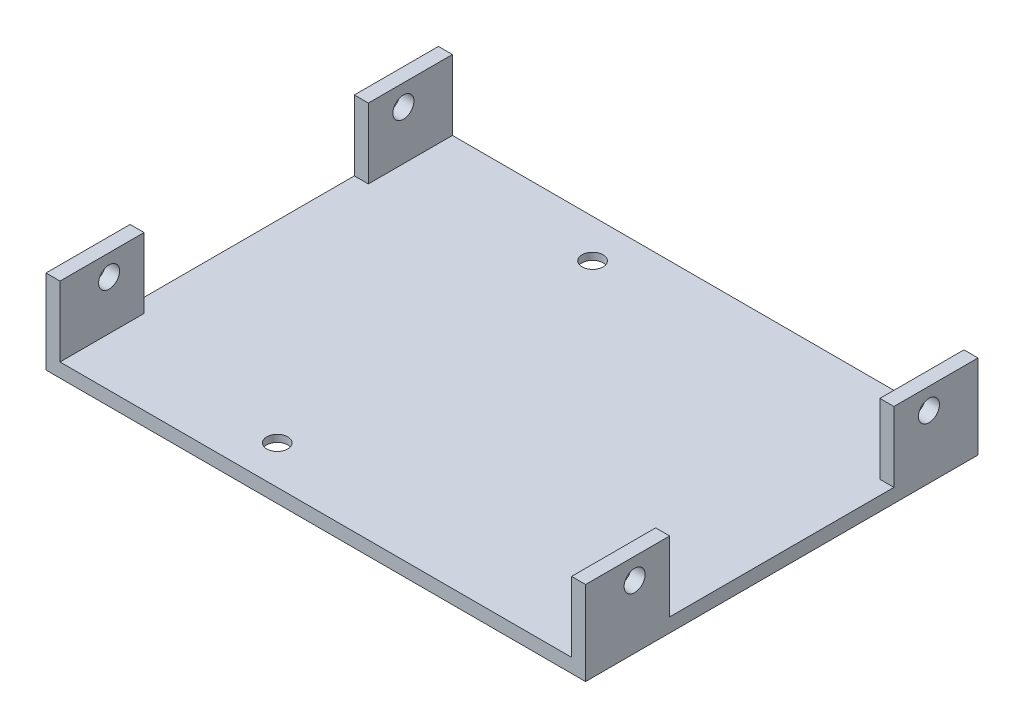
ISO-10303-21;
HEADER;
FILE_DESCRIPTION(('STEP AP214'),'2;1');
FILE_NAME('part.step','',(''),(''),'','','');
FILE_SCHEMA(('AUTOMOTIVE_DESIGN { 1 0 10303 214 1 1 1 1 }'));
ENDSEC;
DATA;
#1=APPLICATION_CONTEXT('core data for automotive mechanical design processes');
#2=APPLICATION_PROTOCOL_DEFINITION('international standard','automotive_design',2000,#1);
#3=PRODUCT_CONTEXT('',#1,'mechanical');
#4=PRODUCT('Part','Part','',(#3));
#5=PRODUCT_RELATED_PRODUCT_CATEGORY('part','',(#4));
#6=PRODUCT_DEFINITION_FORMATION('','',#4);
#7=PRODUCT_DEFINITION_CONTEXT('part definition',#1,'design');
#8=PRODUCT_DEFINITION('design','',#6,#7);
#9=PRODUCT_DEFINITION_SHAPE('','',#8);
#10=(LENGTH_UNIT() NAMED_UNIT(*) SI_UNIT(.MILLI.,.METRE.));
#11=(NAMED_UNIT(*) PLANE_ANGLE_UNIT() SI_UNIT($,.RADIAN.));
#12=(NAMED_UNIT(*) SI_UNIT($,.STERADIAN.) SOLID_ANGLE_UNIT());
#13=UNCERTAINTY_MEASURE_WITH_UNIT(LENGTH_MEASURE(1.E-05),#10,'distance_accuracy_value','');
#14=(GEOMETRIC_REPRESENTATION_CONTEXT(3) GLOBAL_UNCERTAINTY_ASSIGNED_CONTEXT((#13)) GLOBAL_UNIT_ASSIGNED_CONTEXT((#10,
#11,#12)) REPRESENTATION_CONTEXT('',''));
#15=CARTESIAN_POINT('',(0.,0.,0.));
#16=DIRECTION('',(0.,0.,1.));
#17=DIRECTION('',(1.,0.,0.));
#18=AXIS2_PLACEMENT_3D('',#15,#16,#17);
#19=CARTESIAN_POINT('',(30.8794749403342,0.,-16.409307875895));
#20=DIRECTION('',(0.,1.,0.));
#21=DIRECTION('',(0.,0.,1.));
#22=AXIS2_PLACEMENT_3D('',#19,#20,#21);
#23=CYLINDRICAL_SURFACE('',#22,1.50000000000001);
#24=CARTESIAN_POINT('',(30.8794749403342,2.,-16.409307875895));
#25=DIRECTION('',(0.,1.,0.));
#26=DIRECTION('',(0.,0.,1.));
#27=AXIS2_PLACEMENT_3D('',#24,#25,#26);
#28=CIRCLE('',#27,1.50000000000001);
#29=CARTESIAN_POINT('',(30.8794749403342,2.,-14.909307875895));
#30=VERTEX_POINT('',#29);
#31=EDGE_CURVE('E264',#30,#30,#28,.T.);
#32=ORIENTED_EDGE('',*,*,#31,.T.);
#33=EDGE_LOOP('',(#32));
#34=FACE_BOUND('',#33,.T.);
#35=CARTESIAN_POINT('',(30.8794749403342,1.,-16.409307875895));
#36=DIRECTION('',(0.,-1.,0.));
#37=DIRECTION('',(0.,0.,-1.));
#38=AXIS2_PLACEMENT_3D('',#35,#36,#37);
#39=CIRCLE('',#38,1.50000000000001);
#40=CARTESIAN_POINT('',(30.8794749403342,1.,-17.909307875895));
#41=VERTEX_POINT('',#40);
#42=EDGE_CURVE('E37',#41,#41,#39,.F.);
#43=ORIENTED_EDGE('',*,*,#42,.F.);
#44=EDGE_LOOP('',(#43));
#45=FACE_BOUND('',#44,.T.);
#46=ADVANCED_FACE('F33',(#34,#45),#23,.F.);
#47=CARTESIAN_POINT('',(-14.1205250596658,0.,28.590692124105));
#48=DIRECTION('',(0.,1.,0.));
#49=DIRECTION('',(0.,0.,1.));
#50=AXIS2_PLACEMENT_3D('',#47,#48,#49);
#51=CYLINDRICAL_SURFACE('',#50,1.5);
#52=CARTESIAN_POINT('',(-14.1205250596658,2.,28.590692124105));
#53=DIRECTION('',(0.,1.,0.));
#54=DIRECTION('',(0.,0.,1.));
#55=AXIS2_PLACEMENT_3D('',#52,#53,#54);
#56=CIRCLE('',#55,1.5);
#57=CARTESIAN_POINT('',(-14.1205250596658,2.,30.090692124105));
#58=VERTEX_POINT('',#57);
#59=EDGE_CURVE('E257',#58,#58,#56,.T.);
#60=ORIENTED_EDGE('',*,*,#59,.T.);
#61=EDGE_LOOP('',(#60));
#62=FACE_BOUND('',#61,.T.);
#63=CARTESIAN_POINT('',(-14.1205250596658,1.,28.590692124105));
#64=DIRECTION('',(0.,-1.,0.));
#65=DIRECTION('',(0.,0.,-1.));
#66=AXIS2_PLACEMENT_3D('',#63,#64,#65);
#67=CIRCLE('',#66,1.5);
#68=CARTESIAN_POINT('',(-14.1205250596658,1.,27.090692124105));
#69=VERTEX_POINT('',#68);
#70=EDGE_CURVE('E304',#69,#69,#67,.F.);
#71=ORIENTED_EDGE('',*,*,#70,.F.);
#72=EDGE_LOOP('',(#71));
#73=FACE_BOUND('',#72,.T.);
#74=ADVANCED_FACE('F346',(#62,#73),#51,.F.);
#75=CARTESIAN_POINT('',(-14.1205250596658,0.,-16.409307875895));
#76=DIRECTION('',(0.,1.,0.));
#77=DIRECTION('',(0.,0.,1.));
#78=AXIS2_PLACEMENT_3D('',#75,#76,#77);
#79=CYLINDRICAL_SURFACE('',#78,1.5);
#80=CARTESIAN_POINT('',(-14.1205250596658,2.,-16.409307875895));
#81=DIRECTION('',(0.,1.,0.));
#82=DIRECTION('',(0.,0.,1.));
#83=AXIS2_PLACEMENT_3D('',#80,#81,#82);
#84=CIRCLE('',#83,1.5);
#85=CARTESIAN_POINT('',(-14.1205250596658,2.,-14.909307875895));
#86=VERTEX_POINT('',#85);
#87=EDGE_CURVE('E260',#86,#86,#84,.T.);
#88=ORIENTED_EDGE('',*,*,#87,.T.);
#89=EDGE_LOOP('',(#88));
#90=FACE_BOUND('',#89,.T.);
#91=CARTESIAN_POINT('',(-14.1205250596658,1.,-16.409307875895));
#92=DIRECTION('',(0.,-1.,0.));
#93=DIRECTION('',(0.,0.,-1.));
#94=AXIS2_PLACEMENT_3D('',#91,#92,#93);
#95=CIRCLE('',#94,1.5);
#96=CARTESIAN_POINT('',(-14.1205250596658,1.,-17.909307875895));
#97=VERTEX_POINT('',#96);
#98=EDGE_CURVE('E301',#97,#97,#95,.F.);
#99=ORIENTED_EDGE('',*,*,#98,.F.);
#100=EDGE_LOOP('',(#99));
#101=FACE_BOUND('',#100,.T.);
#102=ADVANCED_FACE('F352',(#90,#101),#79,.F.);
#103=CARTESIAN_POINT('',(30.8794749403342,0.,28.590692124105));
#104=DIRECTION('',(0.,1.,0.));
#105=DIRECTION('',(0.,0.,1.));
#106=AXIS2_PLACEMENT_3D('',#103,#104,#105);
#107=CYLINDRICAL_SURFACE('',#106,1.50000000000001);
#108=CARTESIAN_POINT('',(30.8794749403342,2.,28.590692124105));
#109=DIRECTION('',(0.,1.,0.));
#110=DIRECTION('',(0.,0.,1.));
#111=AXIS2_PLACEMENT_3D('',#108,#109,#110);
#112=CIRCLE('',#111,1.50000000000001);
#113=CARTESIAN_POINT('',(30.8794749403342,2.,30.090692124105));
#114=VERTEX_POINT('',#113);
#115=EDGE_CURVE('E261',#114,#114,#112,.T.);
#116=ORIENTED_EDGE('',*,*,#115,.T.);
#117=EDGE_LOOP('',(#116));
#118=FACE_BOUND('',#117,.T.);
#119=CARTESIAN_POINT('',(30.8794749403342,1.,28.590692124105));
#120=DIRECTION('',(0.,-1.,0.));
#121=DIRECTION('',(0.,0.,-1.));
#122=AXIS2_PLACEMENT_3D('',#119,#120,#121);
#123=CIRCLE('',#122,1.50000000000001);
#124=CARTESIAN_POINT('',(30.8794749403342,1.,27.090692124105));
#125=VERTEX_POINT('',#124);
#126=EDGE_CURVE('E298',#125,#125,#123,.F.);
#127=ORIENTED_EDGE('',*,*,#126,.F.);
#128=EDGE_LOOP('',(#127));
#129=FACE_BOUND('',#128,.T.);
#130=ADVANCED_FACE('F362',(#118,#129),#107,.F.);
#131=CARTESIAN_POINT('',(0.,2.,0.));
#132=DIRECTION('',(0.,1.,0.));
#133=DIRECTION('',(0.,0.,1.));
#134=AXIS2_PLACEMENT_3D('',#131,#132,#133);
#135=PLANE('',#134);
#136=ORIENTED_EDGE('',*,*,#115,.F.);
#137=EDGE_LOOP('',(#136));
#138=FACE_BOUND('',#137,.T.);
#139=ORIENTED_EDGE('',*,*,#87,.F.);
#140=EDGE_LOOP('',(#139));
#141=FACE_BOUND('',#140,.T.);
#142=ORIENTED_EDGE('',*,*,#59,.F.);
#143=EDGE_LOOP('',(#142));
#144=FACE_BOUND('',#143,.T.);
#145=ORIENTED_EDGE('',*,*,#31,.F.);
#146=EDGE_LOOP('',(#145));
#147=FACE_BOUND('',#146,.T.);
#148=DIRECTION('',(-1.,0.,0.));
#149=VECTOR('',#148,1.);
#150=CARTESIAN_POINT('',(-41.6205250596658,2.,22.090692124105));
#151=LINE('',#150,#149);
#152=CARTESIAN_POINT('',(-39.6205250596658,2.,22.090692124105));
#153=VERTEX_POINT('',#152);
#154=CARTESIAN_POINT('',(-41.6205250596658,2.,22.090692124105));
#155=VERTEX_POINT('',#154);
#156=EDGE_CURVE('E50',#153,#155,#151,.T.);
#157=ORIENTED_EDGE('',*,*,#156,.F.);
#158=DIRECTION('',(0.,0.,-1.));
#159=VECTOR('',#158,1.);
#160=CARTESIAN_POINT('',(-39.6205250596658,2.,22.090692124105));
#161=LINE('',#160,#159);
#162=CARTESIAN_POINT('',(-39.6205250596658,2.,34.090692124105));
#163=VERTEX_POINT('',#162);
#164=EDGE_CURVE('E169',#163,#153,#161,.T.);
#165=ORIENTED_EDGE('',*,*,#164,.F.);
#166=DIRECTION('',(1.,0.,0.));
#167=VECTOR('',#166,1.);
#168=CARTESIAN_POINT('',(-41.6205250596658,2.,34.090692124105));
#169=LINE('',#168,#167);
#170=CARTESIAN_POINT('',(33.3794749403342,2.,34.090692124105));
#171=VERTEX_POINT('',#170);
#172=EDGE_CURVE('E270',#163,#171,#169,.T.);
#173=ORIENTED_EDGE('',*,*,#172,.T.);
#174=DIRECTION('',(0.,0.,1.));
#175=VECTOR('',#174,1.);
#176=CARTESIAN_POINT('',(33.3794749403342,2.,22.090692124105));
#177=LINE('',#176,#175);
#178=CARTESIAN_POINT('',(33.3794749403342,2.,22.090692124105));
#179=VERTEX_POINT('',#178);
#180=EDGE_CURVE('E209',#179,#171,#177,.T.);
#181=ORIENTED_EDGE('',*,*,#180,.F.);
#182=DIRECTION('',(-1.,0.,0.));
#183=VECTOR('',#182,1.);
#184=CARTESIAN_POINT('',(33.3794749403342,2.,22.090692124105));
#185=LINE('',#184,#183);
#186=CARTESIAN_POINT('',(35.3794749403342,2.,22.090692124105));
#187=VERTEX_POINT('',#186);
#188=EDGE_CURVE('E214',#187,#179,#185,.T.);
#189=ORIENTED_EDGE('',*,*,#188,.F.);
#190=DIRECTION('',(0.,0.,-1.));
#191=VECTOR('',#190,1.);
#192=CARTESIAN_POINT('',(35.3794749403341,2.,-21.909307875895));
#193=LINE('',#192,#191);
#194=CARTESIAN_POINT('',(35.3794749403342,2.,-9.90930787589499));
#195=VERTEX_POINT('',#194);
#196=EDGE_CURVE('E273',#187,#195,#193,.T.);
#197=ORIENTED_EDGE('',*,*,#196,.T.);
#198=DIRECTION('',(1.,0.,0.));
#199=VECTOR('',#198,1.);
#200=CARTESIAN_POINT('',(33.3794749403342,2.,-9.90930787589499));
#201=LINE('',#200,#199);
#202=CARTESIAN_POINT('',(33.3794749403342,2.,-9.90930787589499));
#203=VERTEX_POINT('',#202);
#204=EDGE_CURVE('E237',#203,#195,#201,.T.);
#205=ORIENTED_EDGE('',*,*,#204,.F.);
#206=DIRECTION('',(0.,0.,1.));
#207=VECTOR('',#206,1.);
#208=CARTESIAN_POINT('',(33.3794749403342,2.,-21.909307875895));
#209=LINE('',#208,#207);
#210=CARTESIAN_POINT('',(33.3794749403342,2.,-21.909307875895));
#211=VERTEX_POINT('',#210);
#212=EDGE_CURVE('E232',#211,#203,#209,.T.);
#213=ORIENTED_EDGE('',*,*,#212,.F.);
#214=DIRECTION('',(-1.,0.,0.));
#215=VECTOR('',#214,1.);
#216=CARTESIAN_POINT('',(-41.6205250596658,2.,-21.909307875895));
#217=LINE('',#216,#215);
#218=CARTESIAN_POINT('',(-39.6205250596658,2.,-21.909307875895));
#219=VERTEX_POINT('',#218);
#220=EDGE_CURVE('E275',#211,#219,#217,.T.);
#221=ORIENTED_EDGE('',*,*,#220,.T.);
#222=DIRECTION('',(0.,0.,-1.));
#223=VECTOR('',#222,1.);
#224=CARTESIAN_POINT('',(-39.6205250596658,2.,-21.909307875895));
#225=LINE('',#224,#223);
#226=CARTESIAN_POINT('',(-39.6205250596658,2.,-9.90930787589499));
#227=VERTEX_POINT('',#226);
#228=EDGE_CURVE('E189',#227,#219,#225,.T.);
#229=ORIENTED_EDGE('',*,*,#228,.F.);
#230=DIRECTION('',(1.,0.,0.));
#231=VECTOR('',#230,1.);
#232=CARTESIAN_POINT('',(-41.6205250596658,2.,-9.90930787589499));
#233=LINE('',#232,#231);
#234=CARTESIAN_POINT('',(-41.6205250596658,2.,-9.90930787589499));
#235=VERTEX_POINT('',#234);
#236=EDGE_CURVE('E184',#235,#227,#233,.T.);
#237=ORIENTED_EDGE('',*,*,#236,.F.);
#238=DIRECTION('',(0.,0.,1.));
#239=VECTOR('',#238,1.);
#240=CARTESIAN_POINT('',(-41.6205250596658,2.,-21.909307875895));
#241=LINE('',#240,#239);
#242=EDGE_CURVE('E55',#235,#155,#241,.T.);
#243=ORIENTED_EDGE('',*,*,#242,.T.);
#244=EDGE_LOOP('',(#157,#165,#173,#181,#189,#197,#205,#213,#221,#229,#237,#243));
#245=FACE_BOUND('',#244,.T.);
#246=ADVANCED_FACE('F359',(#138,#141,#144,#147,#245),#135,.T.);
#247=CARTESIAN_POINT('',(-41.6205250596658,2.,-21.909307875895));
#248=DIRECTION('',(1.,0.,0.));
#249=DIRECTION('',(0.,0.,-1.));
#250=AXIS2_PLACEMENT_3D('',#247,#248,#249);
#251=PLANE('',#250);
#252=CARTESIAN_POINT('',(-41.6205250596658,9.,27.090692124105));
#253=DIRECTION('',(1.,0.,0.));
#254=DIRECTION('',(0.,0.,-1.));
#255=AXIS2_PLACEMENT_3D('',#252,#253,#254);
#256=CIRCLE('',#255,1.5);
#257=CARTESIAN_POINT('',(-41.6205250596658,9.,25.590692124105));
#258=VERTEX_POINT('',#257);
#259=EDGE_CURVE('E294',#258,#258,#256,.T.);
#260=ORIENTED_EDGE('',*,*,#259,.T.);
#261=EDGE_LOOP('',(#260));
#262=FACE_BOUND('',#261,.T.);
#263=CARTESIAN_POINT('',(-41.6205250596658,9.,-14.909307875895));
#264=DIRECTION('',(1.,0.,0.));
#265=DIRECTION('',(0.,0.,-1.));
#266=AXIS2_PLACEMENT_3D('',#263,#264,#265);
#267=CIRCLE('',#266,1.5);
#268=CARTESIAN_POINT('',(-41.6205250596658,9.,-16.409307875895));
#269=VERTEX_POINT('',#268);
#270=EDGE_CURVE('E313',#269,#269,#267,.T.);
#271=ORIENTED_EDGE('',*,*,#270,.T.);
#272=EDGE_LOOP('',(#271));
#273=FACE_BOUND('',#272,.T.);
#274=DIRECTION('',(0.,0.,1.));
#275=VECTOR('',#274,1.);
#276=CARTESIAN_POINT('',(-41.6205250596658,0.,-21.909307875895));
#277=LINE('',#276,#275);
#278=CARTESIAN_POINT('',(-41.6205250596658,0.,-21.909307875895));
#279=VERTEX_POINT('',#278);
#280=CARTESIAN_POINT('',(-41.6205250596658,0.,34.090692124105));
#281=VERTEX_POINT('',#280);
#282=EDGE_CURVE('E153',#279,#281,#277,.T.);
#283=ORIENTED_EDGE('',*,*,#282,.T.);
#284=DIRECTION('',(0.,-1.,0.));
#285=VECTOR('',#284,1.);
#286=CARTESIAN_POINT('',(-41.6205250596658,2.,34.090692124105));
#287=LINE('',#286,#285);
#288=CARTESIAN_POINT('',(-41.6205250596658,12.,34.090692124105));
#289=VERTEX_POINT('',#288);
#290=EDGE_CURVE('E11',#289,#281,#287,.T.);
#291=ORIENTED_EDGE('',*,*,#290,.F.);
#292=DIRECTION('',(0.,0.,1.));
#293=VECTOR('',#292,1.);
#294=CARTESIAN_POINT('',(-41.6205250596658,12.,22.090692124105));
#295=LINE('',#294,#293);
#296=CARTESIAN_POINT('',(-41.6205250596658,12.,22.090692124105));
#297=VERTEX_POINT('',#296);
#298=EDGE_CURVE('E150',#297,#289,#295,.T.);
#299=ORIENTED_EDGE('',*,*,#298,.F.);
#300=DIRECTION('',(0.,-1.,0.));
#301=VECTOR('',#300,1.);
#302=CARTESIAN_POINT('',(-41.6205250596658,12.,22.090692124105));
#303=LINE('',#302,#301);
#304=EDGE_CURVE('E177',#297,#155,#303,.T.);
#305=ORIENTED_EDGE('',*,*,#304,.T.);
#306=ORIENTED_EDGE('',*,*,#242,.F.);
#307=DIRECTION('',(0.,-1.,0.));
#308=VECTOR('',#307,1.);
#309=CARTESIAN_POINT('',(-41.6205250596658,12.,-9.90930787589499));
#310=LINE('',#309,#308);
#311=CARTESIAN_POINT('',(-41.6205250596658,12.,-9.90930787589499));
#312=VERTEX_POINT('',#311);
#313=EDGE_CURVE('E206',#312,#235,#310,.T.);
#314=ORIENTED_EDGE('',*,*,#313,.F.);
#315=DIRECTION('',(0.,0.,1.));
#316=VECTOR('',#315,1.);
#317=CARTESIAN_POINT('',(-41.6205250596658,12.,-21.909307875895));
#318=LINE('',#317,#316);
#319=CARTESIAN_POINT('',(-41.6205250596658,12.,-21.909307875895));
#320=VERTEX_POINT('',#319);
#321=EDGE_CURVE('E185',#320,#312,#318,.T.);
#322=ORIENTED_EDGE('',*,*,#321,.F.);
#323=DIRECTION('',(0.,-1.,0.));
#324=VECTOR('',#323,1.);
#325=CARTESIAN_POINT('',(-41.6205250596658,2.,-21.909307875895));
#326=LINE('',#325,#324);
#327=EDGE_CURVE('E277',#320,#279,#326,.T.);
#328=ORIENTED_EDGE('',*,*,#327,.T.);
#329=EDGE_LOOP('',(#283,#291,#299,#305,#306,#314,#322,#328));
#330=FACE_BOUND('',#329,.T.);
#331=ADVANCED_FACE('F35',(#262,#273,#330),#251,.F.);
#332=CARTESIAN_POINT('',(-41.6205250596658,2.,34.090692124105));
#333=DIRECTION('',(0.,0.,-1.));
#334=DIRECTION('',(-1.,0.,0.));
#335=AXIS2_PLACEMENT_3D('',#332,#333,#334);
#336=PLANE('',#335);
#337=DIRECTION('',(1.,0.,0.));
#338=VECTOR('',#337,1.);
#339=CARTESIAN_POINT('',(-41.6205250596658,0.,34.090692124105));
#340=LINE('',#339,#338);
#341=CARTESIAN_POINT('',(35.3794749403342,0.,34.090692124105));
#342=VERTEX_POINT('',#341);
#343=EDGE_CURVE('E279',#281,#342,#340,.T.);
#344=ORIENTED_EDGE('',*,*,#343,.T.);
#345=DIRECTION('',(0.,-1.,0.));
#346=VECTOR('',#345,1.);
#347=CARTESIAN_POINT('',(35.3794749403342,2.,34.090692124105));
#348=LINE('',#347,#346);
#349=CARTESIAN_POINT('',(35.3794749403342,12.,34.090692124105));
#350=VERTEX_POINT('',#349);
#351=EDGE_CURVE('E42',#350,#342,#348,.T.);
#352=ORIENTED_EDGE('',*,*,#351,.F.);
#353=DIRECTION('',(1.,0.,0.));
#354=VECTOR('',#353,1.);
#355=CARTESIAN_POINT('',(33.3794749403342,12.,34.090692124105));
#356=LINE('',#355,#354);
#357=CARTESIAN_POINT('',(33.3794749403342,12.,34.090692124105));
#358=VERTEX_POINT('',#357);
#359=EDGE_CURVE('E213',#358,#350,#356,.T.);
#360=ORIENTED_EDGE('',*,*,#359,.F.);
#361=DIRECTION('',(0.,-1.,0.));
#362=VECTOR('',#361,1.);
#363=CARTESIAN_POINT('',(33.3794749403342,12.,34.090692124105));
#364=LINE('',#363,#362);
#365=EDGE_CURVE('E229',#358,#171,#364,.T.);
#366=ORIENTED_EDGE('',*,*,#365,.T.);
#367=ORIENTED_EDGE('',*,*,#172,.F.);
#368=DIRECTION('',(0.,-1.,0.));
#369=VECTOR('',#368,1.);
#370=CARTESIAN_POINT('',(-39.6205250596658,12.,34.090692124105));
#371=LINE('',#370,#369);
#372=CARTESIAN_POINT('',(-39.6205250596658,12.,34.090692124105));
#373=VERTEX_POINT('',#372);
#374=EDGE_CURVE('E159',#373,#163,#371,.T.);
#375=ORIENTED_EDGE('',*,*,#374,.F.);
#376=DIRECTION('',(1.,0.,0.));
#377=VECTOR('',#376,1.);
#378=CARTESIAN_POINT('',(-41.6205250596658,12.,34.090692124105));
#379=LINE('',#378,#377);
#380=EDGE_CURVE('E156',#289,#373,#379,.T.);
#381=ORIENTED_EDGE('',*,*,#380,.F.);
#382=ORIENTED_EDGE('',*,*,#290,.T.);
#383=EDGE_LOOP('',(#344,#352,#360,#366,#367,#375,#381,#382));
#384=FACE_BOUND('',#383,.T.);
#385=ADVANCED_FACE('F157',(#384),#336,.F.);
#386=CARTESIAN_POINT('',(35.3794749403341,2.,-21.909307875895));
#387=DIRECTION('',(-1.,0.,0.));
#388=DIRECTION('',(0.,0.,1.));
#389=AXIS2_PLACEMENT_3D('',#386,#387,#388);
#390=PLANE('',#389);
#391=CARTESIAN_POINT('',(35.3794749403341,9.,27.090692124105));
#392=DIRECTION('',(1.,0.,0.));
#393=DIRECTION('',(0.,0.,-1.));
#394=AXIS2_PLACEMENT_3D('',#391,#392,#393);
#395=CIRCLE('',#394,1.5);
#396=CARTESIAN_POINT('',(35.3794749403341,9.,25.590692124105));
#397=VERTEX_POINT('',#396);
#398=EDGE_CURVE('E318',#397,#397,#395,.T.);
#399=ORIENTED_EDGE('',*,*,#398,.F.);
#400=EDGE_LOOP('',(#399));
#401=FACE_BOUND('',#400,.T.);
#402=CARTESIAN_POINT('',(35.3794749403341,9.,-14.909307875895));
#403=DIRECTION('',(1.,0.,0.));
#404=DIRECTION('',(0.,0.,-1.));
#405=AXIS2_PLACEMENT_3D('',#402,#403,#404);
#406=CIRCLE('',#405,1.5);
#407=CARTESIAN_POINT('',(35.3794749403341,9.,-16.409307875895));
#408=VERTEX_POINT('',#407);
#409=EDGE_CURVE('E309',#408,#408,#406,.T.);
#410=ORIENTED_EDGE('',*,*,#409,.F.);
#411=EDGE_LOOP('',(#410));
#412=FACE_BOUND('',#411,.T.);
#413=DIRECTION('',(0.,0.,-1.));
#414=VECTOR('',#413,1.);
#415=CARTESIAN_POINT('',(35.3794749403341,0.,-21.909307875895));
#416=LINE('',#415,#414);
#417=CARTESIAN_POINT('',(35.3794749403341,0.,-21.909307875895));
#418=VERTEX_POINT('',#417);
#419=EDGE_CURVE('E281',#342,#418,#416,.T.);
#420=ORIENTED_EDGE('',*,*,#419,.T.);
#421=DIRECTION('',(0.,-1.,0.));
#422=VECTOR('',#421,1.);
#423=CARTESIAN_POINT('',(35.3794749403341,2.,-21.909307875895));
#424=LINE('',#423,#422);
#425=CARTESIAN_POINT('',(35.3794749403342,12.,-21.909307875895));
#426=VERTEX_POINT('',#425);
#427=EDGE_CURVE('E285',#426,#418,#424,.T.);
#428=ORIENTED_EDGE('',*,*,#427,.F.);
#429=DIRECTION('',(0.,0.,-1.));
#430=VECTOR('',#429,1.);
#431=CARTESIAN_POINT('',(35.3794749403342,12.,-21.909307875895));
#432=LINE('',#431,#430);
#433=CARTESIAN_POINT('',(35.3794749403342,12.,-9.90930787589499));
#434=VERTEX_POINT('',#433);
#435=EDGE_CURVE('E239',#434,#426,#432,.T.);
#436=ORIENTED_EDGE('',*,*,#435,.F.);
#437=DIRECTION('',(0.,-1.,0.));
#438=VECTOR('',#437,1.);
#439=CARTESIAN_POINT('',(35.3794749403342,12.,-9.90930787589499));
#440=LINE('',#439,#438);
#441=EDGE_CURVE('E251',#434,#195,#440,.T.);
#442=ORIENTED_EDGE('',*,*,#441,.T.);
#443=ORIENTED_EDGE('',*,*,#196,.F.);
#444=DIRECTION('',(0.,-1.,0.));
#445=VECTOR('',#444,1.);
#446=CARTESIAN_POINT('',(35.3794749403342,12.,22.090692124105));
#447=LINE('',#446,#445);
#448=CARTESIAN_POINT('',(35.3794749403342,12.,22.090692124105));
#449=VERTEX_POINT('',#448);
#450=EDGE_CURVE('E227',#449,#187,#447,.T.);
#451=ORIENTED_EDGE('',*,*,#450,.F.);
#452=DIRECTION('',(0.,0.,-1.));
#453=VECTOR('',#452,1.);
#454=CARTESIAN_POINT('',(35.3794749403342,12.,22.090692124105));
#455=LINE('',#454,#453);
#456=EDGE_CURVE('E217',#350,#449,#455,.T.);
#457=ORIENTED_EDGE('',*,*,#456,.F.);
#458=ORIENTED_EDGE('',*,*,#351,.T.);
#459=EDGE_LOOP('',(#420,#428,#436,#442,#443,#451,#457,#458));
#460=FACE_BOUND('',#459,.T.);
#461=ADVANCED_FACE('F372',(#401,#412,#460),#390,.F.);
#462=CARTESIAN_POINT('',(-41.6205250596658,2.,-21.909307875895));
#463=DIRECTION('',(0.,0.,1.));
#464=DIRECTION('',(1.,0.,0.));
#465=AXIS2_PLACEMENT_3D('',#462,#463,#464);
#466=PLANE('',#465);
#467=DIRECTION('',(-1.,0.,0.));
#468=VECTOR('',#467,1.);
#469=CARTESIAN_POINT('',(-41.6205250596658,0.,-21.909307875895));
#470=LINE('',#469,#468);
#471=EDGE_CURVE('E271',#418,#279,#470,.T.);
#472=ORIENTED_EDGE('',*,*,#471,.T.);
#473=ORIENTED_EDGE('',*,*,#327,.F.);
#474=DIRECTION('',(-1.,0.,0.));
#475=VECTOR('',#474,1.);
#476=CARTESIAN_POINT('',(-41.6205250596658,12.,-21.909307875895));
#477=LINE('',#476,#475);
#478=CARTESIAN_POINT('',(-39.6205250596658,12.,-21.909307875895));
#479=VERTEX_POINT('',#478);
#480=EDGE_CURVE('E193',#479,#320,#477,.T.);
#481=ORIENTED_EDGE('',*,*,#480,.F.);
#482=DIRECTION('',(0.,-1.,0.));
#483=VECTOR('',#482,1.);
#484=CARTESIAN_POINT('',(-39.6205250596658,12.,-21.909307875895));
#485=LINE('',#484,#483);
#486=EDGE_CURVE('E196',#479,#219,#485,.T.);
#487=ORIENTED_EDGE('',*,*,#486,.T.);
#488=ORIENTED_EDGE('',*,*,#220,.F.);
#489=DIRECTION('',(0.,-1.,0.));
#490=VECTOR('',#489,1.);
#491=CARTESIAN_POINT('',(33.3794749403342,12.,-21.909307875895));
#492=LINE('',#491,#490);
#493=CARTESIAN_POINT('',(33.3794749403342,12.,-21.909307875895));
#494=VERTEX_POINT('',#493);
#495=EDGE_CURVE('E244',#494,#211,#492,.T.);
#496=ORIENTED_EDGE('',*,*,#495,.F.);
#497=DIRECTION('',(-1.,0.,0.));
#498=VECTOR('',#497,1.);
#499=CARTESIAN_POINT('',(33.3794749403342,12.,-21.909307875895));
#500=LINE('',#499,#498);
#501=EDGE_CURVE('E242',#426,#494,#500,.T.);
#502=ORIENTED_EDGE('',*,*,#501,.F.);
#503=ORIENTED_EDGE('',*,*,#427,.T.);
#504=EDGE_LOOP('',(#472,#473,#481,#487,#488,#496,#502,#503));
#505=FACE_BOUND('',#504,.T.);
#506=ADVANCED_FACE('F368',(#505),#466,.F.);
#507=CARTESIAN_POINT('',(0.,0.,0.));
#508=DIRECTION('',(0.,1.,0.));
#509=DIRECTION('',(0.,0.,1.));
#510=AXIS2_PLACEMENT_3D('',#507,#508,#509);
#511=PLANE('',#510);
#512=CARTESIAN_POINT('',(-14.1205250596658,0.,-16.409307875895));
#513=DIRECTION('',(0.,-1.,0.));
#514=DIRECTION('',(0.,0.,-1.));
#515=AXIS2_PLACEMENT_3D('',#512,#513,#514);
#516=CIRCLE('',#515,3.25);
#517=CARTESIAN_POINT('',(-14.1205250596658,0.,-19.659307875895));
#518=VERTEX_POINT('',#517);
#519=EDGE_CURVE('E739',#518,#518,#516,.T.);
#520=ORIENTED_EDGE('',*,*,#519,.F.);
#521=EDGE_LOOP('',(#520));
#522=FACE_BOUND('',#521,.T.);
#523=CARTESIAN_POINT('',(30.8794749403342,0.,-16.409307875895));
#524=DIRECTION('',(0.,-1.,0.));
#525=DIRECTION('',(0.,0.,-1.));
#526=AXIS2_PLACEMENT_3D('',#523,#524,#525);
#527=CIRCLE('',#526,3.25);
#528=CARTESIAN_POINT('',(30.8794749403342,0.,-19.659307875895));
#529=VERTEX_POINT('',#528);
#530=EDGE_CURVE('E745',#529,#529,#527,.T.);
#531=ORIENTED_EDGE('',*,*,#530,.F.);
#532=EDGE_LOOP('',(#531));
#533=FACE_BOUND('',#532,.T.);
#534=CARTESIAN_POINT('',(30.8794749403342,0.,28.590692124105));
#535=DIRECTION('',(0.,-1.,0.));
#536=DIRECTION('',(0.,0.,-1.));
#537=AXIS2_PLACEMENT_3D('',#534,#535,#536);
#538=CIRCLE('',#537,3.25);
#539=CARTESIAN_POINT('',(30.8794749403342,0.,25.340692124105));
#540=VERTEX_POINT('',#539);
#541=EDGE_CURVE('E487',#540,#540,#538,.T.);
#542=ORIENTED_EDGE('',*,*,#541,.F.);
#543=EDGE_LOOP('',(#542));
#544=FACE_BOUND('',#543,.T.);
#545=CARTESIAN_POINT('',(-14.1205250596658,0.,28.590692124105));
#546=DIRECTION('',(0.,-1.,0.));
#547=DIRECTION('',(0.,0.,-1.));
#548=AXIS2_PLACEMENT_3D('',#545,#546,#547);
#549=CIRCLE('',#548,3.25);
#550=CARTESIAN_POINT('',(-14.1205250596658,0.,25.340692124105));
#551=VERTEX_POINT('',#550);
#552=EDGE_CURVE('E482',#551,#551,#549,.T.);
#553=ORIENTED_EDGE('',*,*,#552,.F.);
#554=EDGE_LOOP('',(#553));
#555=FACE_BOUND('',#554,.T.);
#556=ORIENTED_EDGE('',*,*,#282,.F.);
#557=ORIENTED_EDGE('',*,*,#471,.F.);
#558=ORIENTED_EDGE('',*,*,#419,.F.);
#559=ORIENTED_EDGE('',*,*,#343,.F.);
#560=EDGE_LOOP('',(#556,#557,#558,#559));
#561=FACE_BOUND('',#560,.T.);
#562=ADVANCED_FACE('F364',(#522,#533,#544,#555,#561),#511,.F.);
#563=CARTESIAN_POINT('',(33.3794749403342,12.,-21.909307875895));
#564=DIRECTION('',(1.,0.,0.));
#565=DIRECTION('',(0.,0.,-1.));
#566=AXIS2_PLACEMENT_3D('',#563,#564,#565);
#567=PLANE('',#566);
#568=CARTESIAN_POINT('',(33.3794749403342,9.,-14.909307875895));
#569=DIRECTION('',(1.,0.,0.));
#570=DIRECTION('',(0.,0.,-1.));
#571=AXIS2_PLACEMENT_3D('',#568,#569,#570);
#572=CIRCLE('',#571,1.5);
#573=CARTESIAN_POINT('',(33.3794749403342,9.,-16.409307875895));
#574=VERTEX_POINT('',#573);
#575=EDGE_CURVE('E172',#574,#574,#572,.T.);
#576=ORIENTED_EDGE('',*,*,#575,.T.);
#577=EDGE_LOOP('',(#576));
#578=FACE_BOUND('',#577,.T.);
#579=ORIENTED_EDGE('',*,*,#212,.T.);
#580=DIRECTION('',(0.,-1.,0.));
#581=VECTOR('',#580,1.);
#582=CARTESIAN_POINT('',(33.3794749403342,12.,-9.90930787589499));
#583=LINE('',#582,#581);
#584=CARTESIAN_POINT('',(33.3794749403342,12.,-9.90930787589499));
#585=VERTEX_POINT('',#584);
#586=EDGE_CURVE('E254',#585,#203,#583,.T.);
#587=ORIENTED_EDGE('',*,*,#586,.F.);
#588=DIRECTION('',(0.,0.,1.));
#589=VECTOR('',#588,1.);
#590=CARTESIAN_POINT('',(33.3794749403342,12.,-21.909307875895));
#591=LINE('',#590,#589);
#592=EDGE_CURVE('E233',#494,#585,#591,.T.);
#593=ORIENTED_EDGE('',*,*,#592,.F.);
#594=ORIENTED_EDGE('',*,*,#495,.T.);
#595=EDGE_LOOP('',(#579,#587,#593,#594));
#596=FACE_BOUND('',#595,.T.);
#597=ADVANCED_FACE('F367',(#578,#596),#567,.F.);
#598=CARTESIAN_POINT('',(33.3794749403342,12.,-9.90930787589499));
#599=DIRECTION('',(0.,0.,-1.));
#600=DIRECTION('',(-1.,0.,0.));
#601=AXIS2_PLACEMENT_3D('',#598,#599,#600);
#602=PLANE('',#601);
#603=ORIENTED_EDGE('',*,*,#204,.T.);
#604=ORIENTED_EDGE('',*,*,#441,.F.);
#605=DIRECTION('',(1.,0.,0.));
#606=VECTOR('',#605,1.);
#607=CARTESIAN_POINT('',(33.3794749403342,12.,-9.90930787589499));
#608=LINE('',#607,#606);
#609=EDGE_CURVE('E236',#585,#434,#608,.T.);
#610=ORIENTED_EDGE('',*,*,#609,.F.);
#611=ORIENTED_EDGE('',*,*,#586,.T.);
#612=EDGE_LOOP('',(#603,#604,#610,#611));
#613=FACE_BOUND('',#612,.T.);
#614=ADVANCED_FACE('F425',(#613),#602,.F.);
#615=CARTESIAN_POINT('',(0.,12.,0.));
#616=DIRECTION('',(0.,1.,0.));
#617=DIRECTION('',(0.,0.,1.));
#618=AXIS2_PLACEMENT_3D('',#615,#616,#617);
#619=PLANE('',#618);
#620=ORIENTED_EDGE('',*,*,#592,.T.);
#621=ORIENTED_EDGE('',*,*,#609,.T.);
#622=ORIENTED_EDGE('',*,*,#435,.T.);
#623=ORIENTED_EDGE('',*,*,#501,.T.);
#624=EDGE_LOOP('',(#620,#621,#622,#623));
#625=FACE_BOUND('',#624,.T.);
#626=ADVANCED_FACE('F422',(#625),#619,.T.);
#627=CARTESIAN_POINT('',(33.3794749403342,12.,22.090692124105));
#628=DIRECTION('',(1.,0.,0.));
#629=DIRECTION('',(0.,0.,-1.));
#630=AXIS2_PLACEMENT_3D('',#627,#628,#629);
#631=PLANE('',#630);
#632=CARTESIAN_POINT('',(33.3794749403342,9.,27.090692124105));
#633=DIRECTION('',(1.,0.,0.));
#634=DIRECTION('',(0.,0.,-1.));
#635=AXIS2_PLACEMENT_3D('',#632,#633,#634);
#636=CIRCLE('',#635,1.5);
#637=CARTESIAN_POINT('',(33.3794749403342,9.,25.590692124105));
#638=VERTEX_POINT('',#637);
#639=EDGE_CURVE('E293',#638,#638,#636,.T.);
#640=ORIENTED_EDGE('',*,*,#639,.T.);
#641=EDGE_LOOP('',(#640));
#642=FACE_BOUND('',#641,.T.);
#643=ORIENTED_EDGE('',*,*,#180,.T.);
#644=ORIENTED_EDGE('',*,*,#365,.F.);
#645=DIRECTION('',(0.,0.,1.));
#646=VECTOR('',#645,1.);
#647=CARTESIAN_POINT('',(33.3794749403342,12.,22.090692124105));
#648=LINE('',#647,#646);
#649=CARTESIAN_POINT('',(33.3794749403342,12.,22.090692124105));
#650=VERTEX_POINT('',#649);
#651=EDGE_CURVE('E210',#650,#358,#648,.T.);
#652=ORIENTED_EDGE('',*,*,#651,.F.);
#653=DIRECTION('',(0.,-1.,0.));
#654=VECTOR('',#653,1.);
#655=CARTESIAN_POINT('',(33.3794749403342,12.,22.090692124105));
#656=LINE('',#655,#654);
#657=EDGE_CURVE('E221',#650,#179,#656,.T.);
#658=ORIENTED_EDGE('',*,*,#657,.T.);
#659=EDGE_LOOP('',(#643,#644,#652,#658));
#660=FACE_BOUND('',#659,.T.);
#661=ADVANCED_FACE('F324',(#642,#660),#631,.F.);
#662=CARTESIAN_POINT('',(33.3794749403342,12.,22.090692124105));
#663=DIRECTION('',(0.,0.,1.));
#664=DIRECTION('',(1.,0.,0.));
#665=AXIS2_PLACEMENT_3D('',#662,#663,#664);
#666=PLANE('',#665);
#667=ORIENTED_EDGE('',*,*,#188,.T.);
#668=ORIENTED_EDGE('',*,*,#657,.F.);
#669=DIRECTION('',(-1.,0.,0.));
#670=VECTOR('',#669,1.);
#671=CARTESIAN_POINT('',(33.3794749403342,12.,22.090692124105));
#672=LINE('',#671,#670);
#673=EDGE_CURVE('E219',#449,#650,#672,.T.);
#674=ORIENTED_EDGE('',*,*,#673,.F.);
#675=ORIENTED_EDGE('',*,*,#450,.T.);
#676=EDGE_LOOP('',(#667,#668,#674,#675));
#677=FACE_BOUND('',#676,.T.);
#678=ADVANCED_FACE('F412',(#677),#666,.F.);
#679=CARTESIAN_POINT('',(0.,12.,0.));
#680=DIRECTION('',(0.,1.,0.));
#681=DIRECTION('',(0.,0.,1.));
#682=AXIS2_PLACEMENT_3D('',#679,#680,#681);
#683=PLANE('',#682);
#684=ORIENTED_EDGE('',*,*,#651,.T.);
#685=ORIENTED_EDGE('',*,*,#359,.T.);
#686=ORIENTED_EDGE('',*,*,#456,.T.);
#687=ORIENTED_EDGE('',*,*,#673,.T.);
#688=EDGE_LOOP('',(#684,#685,#686,#687));
#689=FACE_BOUND('',#688,.T.);
#690=ADVANCED_FACE('F407',(#689),#683,.T.);
#691=CARTESIAN_POINT('',(-41.6205250596658,12.,-9.90930787589499));
#692=DIRECTION('',(0.,0.,-1.));
#693=DIRECTION('',(-1.,0.,0.));
#694=AXIS2_PLACEMENT_3D('',#691,#692,#693);
#695=PLANE('',#694);
#696=ORIENTED_EDGE('',*,*,#236,.T.);
#697=DIRECTION('',(0.,-1.,0.));
#698=VECTOR('',#697,1.);
#699=CARTESIAN_POINT('',(-39.6205250596658,12.,-9.90930787589499));
#700=LINE('',#699,#698);
#701=CARTESIAN_POINT('',(-39.6205250596658,12.,-9.90930787589499));
#702=VERTEX_POINT('',#701);
#703=EDGE_CURVE('E203',#702,#227,#700,.T.);
#704=ORIENTED_EDGE('',*,*,#703,.F.);
#705=DIRECTION('',(1.,0.,0.));
#706=VECTOR('',#705,1.);
#707=CARTESIAN_POINT('',(-41.6205250596658,12.,-9.90930787589499));
#708=LINE('',#707,#706);
#709=EDGE_CURVE('E188',#312,#702,#708,.T.);
#710=ORIENTED_EDGE('',*,*,#709,.F.);
#711=ORIENTED_EDGE('',*,*,#313,.T.);
#712=EDGE_LOOP('',(#696,#704,#710,#711));
#713=FACE_BOUND('',#712,.T.);
#714=ADVANCED_FACE('F394',(#713),#695,.F.);
#715=CARTESIAN_POINT('',(-39.6205250596658,12.,-21.909307875895));
#716=DIRECTION('',(-1.,0.,0.));
#717=DIRECTION('',(0.,0.,1.));
#718=AXIS2_PLACEMENT_3D('',#715,#716,#717);
#719=PLANE('',#718);
#720=CARTESIAN_POINT('',(-39.6205250596658,9.,-14.909307875895));
#721=DIRECTION('',(-1.,0.,0.));
#722=DIRECTION('',(0.,0.,1.));
#723=AXIS2_PLACEMENT_3D('',#720,#721,#722);
#724=CIRCLE('',#723,1.5);
#725=CARTESIAN_POINT('',(-39.6205250596658,9.,-13.409307875895));
#726=VERTEX_POINT('',#725);
#727=EDGE_CURVE('E295',#726,#726,#724,.T.);
#728=ORIENTED_EDGE('',*,*,#727,.T.);
#729=EDGE_LOOP('',(#728));
#730=FACE_BOUND('',#729,.T.);
#731=ORIENTED_EDGE('',*,*,#228,.T.);
#732=ORIENTED_EDGE('',*,*,#486,.F.);
#733=DIRECTION('',(0.,0.,-1.));
#734=VECTOR('',#733,1.);
#735=CARTESIAN_POINT('',(-39.6205250596658,12.,-21.909307875895));
#736=LINE('',#735,#734);
#737=EDGE_CURVE('E191',#702,#479,#736,.T.);
#738=ORIENTED_EDGE('',*,*,#737,.F.);
#739=ORIENTED_EDGE('',*,*,#703,.T.);
#740=EDGE_LOOP('',(#731,#732,#738,#739));
#741=FACE_BOUND('',#740,.T.);
#742=ADVANCED_FACE('F390',(#730,#741),#719,.F.);
#743=CARTESIAN_POINT('',(0.,12.,0.));
#744=DIRECTION('',(0.,1.,0.));
#745=DIRECTION('',(0.,0.,1.));
#746=AXIS2_PLACEMENT_3D('',#743,#744,#745);
#747=PLANE('',#746);
#748=ORIENTED_EDGE('',*,*,#321,.T.);
#749=ORIENTED_EDGE('',*,*,#709,.T.);
#750=ORIENTED_EDGE('',*,*,#737,.T.);
#751=ORIENTED_EDGE('',*,*,#480,.T.);
#752=EDGE_LOOP('',(#748,#749,#750,#751));
#753=FACE_BOUND('',#752,.T.);
#754=ADVANCED_FACE('F393',(#753),#747,.T.);
#755=CARTESIAN_POINT('',(-39.6205250596658,12.,22.090692124105));
#756=DIRECTION('',(-1.,0.,0.));
#757=DIRECTION('',(0.,0.,1.));
#758=AXIS2_PLACEMENT_3D('',#755,#756,#757);
#759=PLANE('',#758);
#760=CARTESIAN_POINT('',(-39.6205250596658,9.,27.090692124105));
#761=DIRECTION('',(-1.,0.,0.));
#762=DIRECTION('',(0.,0.,1.));
#763=AXIS2_PLACEMENT_3D('',#760,#761,#762);
#764=CIRCLE('',#763,1.5);
#765=CARTESIAN_POINT('',(-39.6205250596658,9.,28.590692124105));
#766=VERTEX_POINT('',#765);
#767=EDGE_CURVE('E290',#766,#766,#764,.T.);
#768=ORIENTED_EDGE('',*,*,#767,.T.);
#769=EDGE_LOOP('',(#768));
#770=FACE_BOUND('',#769,.T.);
#771=ORIENTED_EDGE('',*,*,#164,.T.);
#772=DIRECTION('',(0.,-1.,0.));
#773=VECTOR('',#772,1.);
#774=CARTESIAN_POINT('',(-39.6205250596658,12.,22.090692124105));
#775=LINE('',#774,#773);
#776=CARTESIAN_POINT('',(-39.6205250596658,12.,22.090692124105));
#777=VERTEX_POINT('',#776);
#778=EDGE_CURVE('E180',#777,#153,#775,.T.);
#779=ORIENTED_EDGE('',*,*,#778,.F.);
#780=DIRECTION('',(0.,0.,-1.));
#781=VECTOR('',#780,1.);
#782=CARTESIAN_POINT('',(-39.6205250596658,12.,22.090692124105));
#783=LINE('',#782,#781);
#784=EDGE_CURVE('E162',#373,#777,#783,.T.);
#785=ORIENTED_EDGE('',*,*,#784,.F.);
#786=ORIENTED_EDGE('',*,*,#374,.T.);
#787=EDGE_LOOP('',(#771,#779,#785,#786));
#788=FACE_BOUND('',#787,.T.);
#789=ADVANCED_FACE('F510',(#770,#788),#759,.F.);
#790=CARTESIAN_POINT('',(-41.6205250596658,12.,22.090692124105));
#791=DIRECTION('',(0.,0.,1.));
#792=DIRECTION('',(1.,0.,0.));
#793=AXIS2_PLACEMENT_3D('',#790,#791,#792);
#794=PLANE('',#793);
#795=ORIENTED_EDGE('',*,*,#156,.T.);
#796=ORIENTED_EDGE('',*,*,#304,.F.);
#797=DIRECTION('',(-1.,0.,0.));
#798=VECTOR('',#797,1.);
#799=CARTESIAN_POINT('',(-41.6205250596658,12.,22.090692124105));
#800=LINE('',#799,#798);
#801=EDGE_CURVE('E166',#777,#297,#800,.T.);
#802=ORIENTED_EDGE('',*,*,#801,.F.);
#803=ORIENTED_EDGE('',*,*,#778,.T.);
#804=EDGE_LOOP('',(#795,#796,#802,#803));
#805=FACE_BOUND('',#804,.T.);
#806=ADVANCED_FACE('F512',(#805),#794,.F.);
#807=CARTESIAN_POINT('',(0.,12.,0.));
#808=DIRECTION('',(0.,1.,0.));
#809=DIRECTION('',(0.,0.,1.));
#810=AXIS2_PLACEMENT_3D('',#807,#808,#809);
#811=PLANE('',#810);
#812=ORIENTED_EDGE('',*,*,#298,.T.);
#813=ORIENTED_EDGE('',*,*,#380,.T.);
#814=ORIENTED_EDGE('',*,*,#784,.T.);
#815=ORIENTED_EDGE('',*,*,#801,.T.);
#816=EDGE_LOOP('',(#812,#813,#814,#815));
#817=FACE_BOUND('',#816,.T.);
#818=ADVANCED_FACE('F164',(#817),#811,.T.);
#819=CARTESIAN_POINT('',(-41.6205250596658,9.,27.090692124105));
#820=DIRECTION('',(1.,0.,0.));
#821=DIRECTION('',(0.,0.,-1.));
#822=AXIS2_PLACEMENT_3D('',#819,#820,#821);
#823=CYLINDRICAL_SURFACE('',#822,1.5);
#824=ORIENTED_EDGE('',*,*,#259,.F.);
#825=EDGE_LOOP('',(#824));
#826=FACE_BOUND('',#825,.T.);
#827=ORIENTED_EDGE('',*,*,#767,.F.);
#828=EDGE_LOOP('',(#827));
#829=FACE_BOUND('',#828,.T.);
#830=ADVANCED_FACE('F333',(#826,#829),#823,.F.);
#831=CARTESIAN_POINT('',(-41.6205250596658,9.,-14.909307875895));
#832=DIRECTION('',(1.,0.,0.));
#833=DIRECTION('',(0.,0.,-1.));
#834=AXIS2_PLACEMENT_3D('',#831,#832,#833);
#835=CYLINDRICAL_SURFACE('',#834,1.5);
#836=ORIENTED_EDGE('',*,*,#270,.F.);
#837=EDGE_LOOP('',(#836));
#838=FACE_BOUND('',#837,.T.);
#839=ORIENTED_EDGE('',*,*,#727,.F.);
#840=EDGE_LOOP('',(#839));
#841=FACE_BOUND('',#840,.T.);
#842=ADVANCED_FACE('F330',(#838,#841),#835,.F.);
#843=ORIENTED_EDGE('',*,*,#398,.T.);
#844=EDGE_LOOP('',(#843));
#845=FACE_BOUND('',#844,.T.);
#846=ORIENTED_EDGE('',*,*,#639,.F.);
#847=EDGE_LOOP('',(#846));
#848=FACE_BOUND('',#847,.T.);
#849=ADVANCED_FACE('F327',(#845,#848),#823,.F.);
#850=ORIENTED_EDGE('',*,*,#409,.T.);
#851=EDGE_LOOP('',(#850));
#852=FACE_BOUND('',#851,.T.);
#853=ORIENTED_EDGE('',*,*,#575,.F.);
#854=EDGE_LOOP('',(#853));
#855=FACE_BOUND('',#854,.T.);
#856=ADVANCED_FACE('F329',(#852,#855),#835,.F.);
#857=CARTESIAN_POINT('',(30.8794749403342,1.,28.590692124105));
#858=DIRECTION('',(0.,-1.,0.));
#859=DIRECTION('',(0.,0.,-1.));
#860=AXIS2_PLACEMENT_3D('',#857,#858,#859);
#861=PLANE('',#860);
#862=CARTESIAN_POINT('',(30.8794749403342,1.,28.590692124105));
#863=DIRECTION('',(0.,-1.,0.));
#864=DIRECTION('',(0.,0.,-1.));
#865=AXIS2_PLACEMENT_3D('',#862,#863,#864);
#866=CIRCLE('',#865,3.25);
#867=CARTESIAN_POINT('',(30.8794749403342,1.,25.340692124105));
#868=VERTEX_POINT('',#867);
#869=EDGE_CURVE('E484',#868,#868,#866,.T.);
#870=ORIENTED_EDGE('',*,*,#869,.T.);
#871=EDGE_LOOP('',(#870));
#872=FACE_BOUND('',#871,.T.);
#873=ORIENTED_EDGE('',*,*,#126,.T.);
#874=EDGE_LOOP('',(#873));
#875=FACE_BOUND('',#874,.T.);
#876=ADVANCED_FACE('F338',(#872,#875),#861,.T.);
#877=CARTESIAN_POINT('',(30.8794749403342,1.,28.590692124105));
#878=DIRECTION('',(0.,-1.,0.));
#879=DIRECTION('',(0.,0.,-1.));
#880=AXIS2_PLACEMENT_3D('',#877,#878,#879);
#881=CYLINDRICAL_SURFACE('',#880,3.25);
#882=ORIENTED_EDGE('',*,*,#869,.F.);
#883=EDGE_LOOP('',(#882));
#884=FACE_BOUND('',#883,.T.);
#885=ORIENTED_EDGE('',*,*,#541,.T.);
#886=EDGE_LOOP('',(#885));
#887=FACE_BOUND('',#886,.T.);
#888=ADVANCED_FACE('F443',(#884,#887),#881,.F.);
#889=CARTESIAN_POINT('',(-14.1205250596658,1.,-16.409307875895));
#890=DIRECTION('',(0.,-1.,0.));
#891=DIRECTION('',(0.,0.,-1.));
#892=AXIS2_PLACEMENT_3D('',#889,#890,#891);
#893=PLANE('',#892);
#894=CARTESIAN_POINT('',(-14.1205250596658,1.,-16.409307875895));
#895=DIRECTION('',(0.,-1.,0.));
#896=DIRECTION('',(0.,0.,-1.));
#897=AXIS2_PLACEMENT_3D('',#894,#895,#896);
#898=CIRCLE('',#897,3.25);
#899=CARTESIAN_POINT('',(-14.1205250596658,1.,-19.659307875895));
#900=VERTEX_POINT('',#899);
#901=EDGE_CURVE('E742',#900,#900,#898,.T.);
#902=ORIENTED_EDGE('',*,*,#901,.T.);
#903=EDGE_LOOP('',(#902));
#904=FACE_BOUND('',#903,.T.);
#905=ORIENTED_EDGE('',*,*,#98,.T.);
#906=EDGE_LOOP('',(#905));
#907=FACE_BOUND('',#906,.T.);
#908=ADVANCED_FACE('F449',(#904,#907),#893,.T.);
#909=CARTESIAN_POINT('',(-14.1205250596658,1.,-16.409307875895));
#910=DIRECTION('',(0.,-1.,0.));
#911=DIRECTION('',(0.,0.,-1.));
#912=AXIS2_PLACEMENT_3D('',#909,#910,#911);
#913=CYLINDRICAL_SURFACE('',#912,3.25);
#914=ORIENTED_EDGE('',*,*,#901,.F.);
#915=EDGE_LOOP('',(#914));
#916=FACE_BOUND('',#915,.T.);
#917=ORIENTED_EDGE('',*,*,#519,.T.);
#918=EDGE_LOOP('',(#917));
#919=FACE_BOUND('',#918,.T.);
#920=ADVANCED_FACE('F465',(#916,#919),#913,.F.);
#921=CARTESIAN_POINT('',(-14.1205250596658,1.,28.590692124105));
#922=DIRECTION('',(0.,-1.,0.));
#923=DIRECTION('',(0.,0.,-1.));
#924=AXIS2_PLACEMENT_3D('',#921,#922,#923);
#925=PLANE('',#924);
#926=CARTESIAN_POINT('',(-14.1205250596658,1.,28.590692124105));
#927=DIRECTION('',(0.,-1.,0.));
#928=DIRECTION('',(0.,0.,-1.));
#929=AXIS2_PLACEMENT_3D('',#926,#927,#928);
#930=CIRCLE('',#929,3.25);
#931=CARTESIAN_POINT('',(-14.1205250596658,1.,25.340692124105));
#932=VERTEX_POINT('',#931);
#933=EDGE_CURVE('E302',#932,#932,#930,.T.);
#934=ORIENTED_EDGE('',*,*,#933,.T.);
#935=EDGE_LOOP('',(#934));
#936=FACE_BOUND('',#935,.T.);
#937=ORIENTED_EDGE('',*,*,#70,.T.);
#938=EDGE_LOOP('',(#937));
#939=FACE_BOUND('',#938,.T.);
#940=ADVANCED_FACE('F469',(#936,#939),#925,.T.);
#941=CARTESIAN_POINT('',(-14.1205250596658,1.,28.590692124105));
#942=DIRECTION('',(0.,-1.,0.));
#943=DIRECTION('',(0.,0.,-1.));
#944=AXIS2_PLACEMENT_3D('',#941,#942,#943);
#945=CYLINDRICAL_SURFACE('',#944,3.25);
#946=ORIENTED_EDGE('',*,*,#933,.F.);
#947=EDGE_LOOP('',(#946));
#948=FACE_BOUND('',#947,.T.);
#949=ORIENTED_EDGE('',*,*,#552,.T.);
#950=EDGE_LOOP('',(#949));
#951=FACE_BOUND('',#950,.T.);
#952=ADVANCED_FACE('F458',(#948,#951),#945,.F.);
#953=CARTESIAN_POINT('',(30.8794749403342,1.,-16.409307875895));
#954=DIRECTION('',(0.,-1.,0.));
#955=DIRECTION('',(0.,0.,-1.));
#956=AXIS2_PLACEMENT_3D('',#953,#954,#955);
#957=PLANE('',#956);
#958=CARTESIAN_POINT('',(30.8794749403342,1.,-16.409307875895));
#959=DIRECTION('',(0.,-1.,0.));
#960=DIRECTION('',(0.,0.,-1.));
#961=AXIS2_PLACEMENT_3D('',#958,#959,#960);
#962=CIRCLE('',#961,3.25);
#963=CARTESIAN_POINT('',(30.8794749403342,1.,-19.659307875895));
#964=VERTEX_POINT('',#963);
#965=EDGE_CURVE('E748',#964,#964,#962,.T.);
#966=ORIENTED_EDGE('',*,*,#965,.T.);
#967=EDGE_LOOP('',(#966));
#968=FACE_BOUND('',#967,.T.);
#969=ORIENTED_EDGE('',*,*,#42,.T.);
#970=EDGE_LOOP('',(#969));
#971=FACE_BOUND('',#970,.T.);
#972=ADVANCED_FACE('F454',(#968,#971),#957,.T.);
#973=CARTESIAN_POINT('',(30.8794749403342,1.,-16.409307875895));
#974=DIRECTION('',(0.,-1.,0.));
#975=DIRECTION('',(0.,0.,-1.));
#976=AXIS2_PLACEMENT_3D('',#973,#974,#975);
#977=CYLINDRICAL_SURFACE('',#976,3.25);
#978=ORIENTED_EDGE('',*,*,#965,.F.);
#979=EDGE_LOOP('',(#978));
#980=FACE_BOUND('',#979,.T.);
#981=ORIENTED_EDGE('',*,*,#530,.T.);
#982=EDGE_LOOP('',(#981));
#983=FACE_BOUND('',#982,.T.);
#984=ADVANCED_FACE('F457',(#980,#983),#977,.F.);
#985=CLOSED_SHELL('',(#46,#74,#102,#130,#246,#331,#385,#461,#506,#562,#597,#614,#626,#661,#678,
#690,#714,#742,#754,#789,#806,#818,#830,#842,#849,#856,#876,#888,#908,#920,#940,#952,#972,#984));
#986=MANIFOLD_SOLID_BREP('B2',#985);
#987=ADVANCED_BREP_SHAPE_REPRESENTATION('',(#18,#986),#14);
#988=SHAPE_DEFINITION_REPRESENTATION(#9,#987);
ENDSEC;
END-ISO-10303-21;
